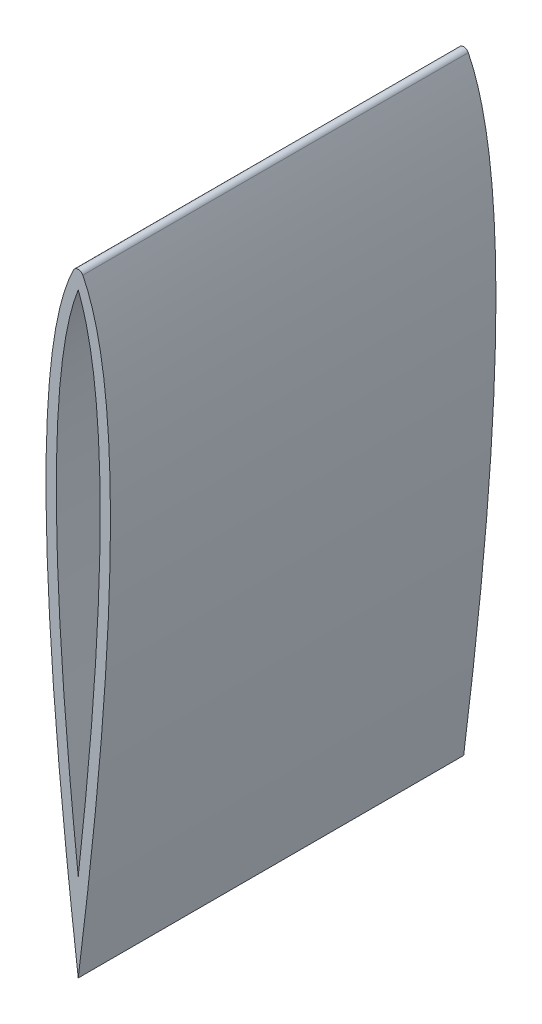
ISO-10303-21;
HEADER;
FILE_DESCRIPTION(('STEP AP214'),'2;1');
FILE_NAME('part.step','',(''),(''),'','','');
FILE_SCHEMA(('AUTOMOTIVE_DESIGN { 1 0 10303 214 1 1 1 1 }'));
ENDSEC;
DATA;
#1=APPLICATION_CONTEXT('core data for automotive mechanical design processes');
#2=APPLICATION_PROTOCOL_DEFINITION('international standard','automotive_design',2000,#1);
#3=PRODUCT_CONTEXT('',#1,'mechanical');
#4=PRODUCT('Part','Part','',(#3));
#5=PRODUCT_RELATED_PRODUCT_CATEGORY('part','',(#4));
#6=PRODUCT_DEFINITION_FORMATION('','',#4);
#7=PRODUCT_DEFINITION_CONTEXT('part definition',#1,'design');
#8=PRODUCT_DEFINITION('design','',#6,#7);
#9=PRODUCT_DEFINITION_SHAPE('','',#8);
#10=(LENGTH_UNIT() NAMED_UNIT(*) SI_UNIT(.MILLI.,.METRE.));
#11=(NAMED_UNIT(*) PLANE_ANGLE_UNIT() SI_UNIT($,.RADIAN.));
#12=(NAMED_UNIT(*) SI_UNIT($,.STERADIAN.) SOLID_ANGLE_UNIT());
#13=UNCERTAINTY_MEASURE_WITH_UNIT(LENGTH_MEASURE(1.E-05),#10,'distance_accuracy_value','');
#14=(GEOMETRIC_REPRESENTATION_CONTEXT(3) GLOBAL_UNCERTAINTY_ASSIGNED_CONTEXT((#13)) GLOBAL_UNIT_ASSIGNED_CONTEXT((#10,
#11,#12)) REPRESENTATION_CONTEXT('',''));
#15=CARTESIAN_POINT('',(0.,0.,0.));
#16=DIRECTION('',(0.,0.,1.));
#17=DIRECTION('',(1.,0.,0.));
#18=AXIS2_PLACEMENT_3D('',#15,#16,#17);
#19=CARTESIAN_POINT('',(15.853163035224,45.1076472609895,94.869));
#20=DIRECTION('',(0.,0.,1.));
#21=DIRECTION('',(1.,0.,0.));
#22=AXIS2_PLACEMENT_3D('',#19,#20,#21);
#23=PLANE('',#22);
#24=CARTESIAN_POINT('',(0.,-152.4,94.869));
#25=CARTESIAN_POINT('',(30.5724401232739,92.2411110099885,94.869));
#26=CARTESIAN_POINT('',(2.26777189434819,148.348367023981,94.869));
#27=B_SPLINE_CURVE_WITH_KNOTS('',2,(#24,#25,#26),.UNSPECIFIED.,.F.,.F.,(3,3),(0.,1.),.UNSPECIFIED.);
#28=CARTESIAN_POINT('',(0.,-152.4,94.869));
#29=VERTEX_POINT('',#28);
#30=CARTESIAN_POINT('',(2.26777189434819,148.348367023981,94.869));
#31=VERTEX_POINT('',#30);
#32=EDGE_CURVE('E145',#29,#31,#27,.T.);
#33=ORIENTED_EDGE('',*,*,#32,.T.);
#34=CARTESIAN_POINT('',(0.,147.204334404164,94.869));
#35=DIRECTION('',(0.,0.,1.));
#36=DIRECTION('',(-1.,0.,0.));
#37=AXIS2_PLACEMENT_3D('',#34,#35,#36);
#38=CIRCLE('',#37,2.53999999999999);
#39=CARTESIAN_POINT('',(-2.26777189434819,148.348367023981,94.869));
#40=VERTEX_POINT('',#39);
#41=EDGE_CURVE('E127',#31,#40,#38,.T.);
#42=ORIENTED_EDGE('',*,*,#41,.T.);
#43=CARTESIAN_POINT('',(-2.26777189434819,148.348367023981,94.869));
#44=CARTESIAN_POINT('',(-30.5724401232739,92.2411110099885,94.869));
#45=CARTESIAN_POINT('',(0.,-152.4,94.869));
#46=B_SPLINE_CURVE_WITH_KNOTS('',2,(#43,#44,#45),.UNSPECIFIED.,.F.,.F.,(3,3),(0.,1.),.UNSPECIFIED.);
#47=EDGE_CURVE('E120',#40,#29,#46,.T.);
#48=ORIENTED_EDGE('',*,*,#47,.T.);
#49=EDGE_LOOP('',(#33,#42,#48));
#50=FACE_BOUND('',#49,.T.);
#51=CARTESIAN_POINT('',(0.,-109.125318419714,94.869));
#52=CARTESIAN_POINT('',(8.16373796542807,-35.5088464124318,94.869));
#53=CARTESIAN_POINT('',(11.1456655969047,45.0401668444738,94.869));
#54=CARTESIAN_POINT('',(10.2425746417,81.4333456049166,94.869));
#55=CARTESIAN_POINT('',(8.16937817155045,106.055563129854,94.869));
#56=CARTESIAN_POINT('',(3.91848207404641,131.156065716608,94.869));
#57=CARTESIAN_POINT('',(0.,140.978035644634,94.869));
#58=B_SPLINE_CURVE_WITH_KNOTS('',2,(#51,#52,#53,#54,#55,#56,#57),.UNSPECIFIED.,.F.,.F.,(3,1,1,1,
1,3),(0.0455268147428226,0.369534324590266,0.531538079513987,0.639540582796468,
0.747543086078949,0.909546841002671),.UNSPECIFIED.);
#59=CARTESIAN_POINT('',(0.,-109.125318419714,94.869));
#60=VERTEX_POINT('',#59);
#61=CARTESIAN_POINT('',(0.,140.978035644634,94.869));
#62=VERTEX_POINT('',#61);
#63=EDGE_CURVE('E81',#60,#62,#58,.T.);
#64=ORIENTED_EDGE('',*,*,#63,.F.);
#65=CARTESIAN_POINT('',(0.,140.978035644635,94.869));
#66=CARTESIAN_POINT('',(-3.91848207404643,131.156065716608,94.869));
#67=CARTESIAN_POINT('',(-8.16937817155045,106.055563129853,94.869));
#68=CARTESIAN_POINT('',(-10.2425746417,81.4333456049166,94.869));
#69=CARTESIAN_POINT('',(-11.1456655969047,45.0401668444737,94.869));
#70=CARTESIAN_POINT('',(-8.16373796542806,-35.5088464124318,94.869));
#71=CARTESIAN_POINT('',(0.,-109.125318419714,94.869));
#72=B_SPLINE_CURVE_WITH_KNOTS('',2,(#65,#66,#67,#68,#69,#70,#71),.UNSPECIFIED.,.F.,.F.,(3,1,1,1,
1,3),(0.0455268147428228,0.207530569666544,0.315533072949025,0.423535576231506,
0.585539331155228,0.909546841002671),.UNSPECIFIED.);
#73=EDGE_CURVE('E87',#62,#60,#72,.T.);
#74=ORIENTED_EDGE('',*,*,#73,.F.);
#75=EDGE_LOOP('',(#64,#74));
#76=FACE_BOUND('',#75,.T.);
#77=ADVANCED_FACE('F34',(#50,#76),#23,.T.);
#78=CARTESIAN_POINT('',(15.853163035224,45.1076472609895,-94.869));
#79=DIRECTION('',(0.,0.,1.));
#80=DIRECTION('',(1.,0.,0.));
#81=AXIS2_PLACEMENT_3D('',#78,#79,#80);
#82=PLANE('',#81);
#83=CARTESIAN_POINT('',(0.,-152.4,-94.869));
#84=CARTESIAN_POINT('',(30.5724401232739,92.2411110099885,-94.869));
#85=CARTESIAN_POINT('',(2.26777189434819,148.348367023981,-94.869));
#86=B_SPLINE_CURVE_WITH_KNOTS('',2,(#83,#84,#85),.UNSPECIFIED.,.F.,.F.,(3,3),(0.,1.),.UNSPECIFIED.);
#87=CARTESIAN_POINT('',(0.,-152.4,-94.869));
#88=VERTEX_POINT('',#87);
#89=CARTESIAN_POINT('',(2.26777189434819,148.348367023981,-94.869));
#90=VERTEX_POINT('',#89);
#91=EDGE_CURVE('E128',#88,#90,#86,.T.);
#92=ORIENTED_EDGE('',*,*,#91,.F.);
#93=CARTESIAN_POINT('',(-2.26777189434819,148.348367023981,-94.869));
#94=CARTESIAN_POINT('',(-30.5724401232739,92.2411110099885,-94.869));
#95=CARTESIAN_POINT('',(0.,-152.4,-94.869));
#96=B_SPLINE_CURVE_WITH_KNOTS('',2,(#93,#94,#95),.UNSPECIFIED.,.F.,.F.,(3,3),(0.,1.),.UNSPECIFIED.);
#97=CARTESIAN_POINT('',(-2.26777189434819,148.348367023981,-94.869));
#98=VERTEX_POINT('',#97);
#99=EDGE_CURVE('E141',#98,#88,#96,.T.);
#100=ORIENTED_EDGE('',*,*,#99,.F.);
#101=CARTESIAN_POINT('',(0.,147.204334404164,-94.869));
#102=DIRECTION('',(0.,0.,1.));
#103=DIRECTION('',(-1.,0.,0.));
#104=AXIS2_PLACEMENT_3D('',#101,#102,#103);
#105=CIRCLE('',#104,2.53999999999999);
#106=EDGE_CURVE('E136',#90,#98,#105,.T.);
#107=ORIENTED_EDGE('',*,*,#106,.F.);
#108=EDGE_LOOP('',(#92,#100,#107));
#109=FACE_BOUND('',#108,.T.);
#110=CARTESIAN_POINT('',(0.,140.978035644635,-94.869));
#111=CARTESIAN_POINT('',(-3.91848207404643,131.156065716608,-94.869));
#112=CARTESIAN_POINT('',(-8.16937817155045,106.055563129853,-94.869));
#113=CARTESIAN_POINT('',(-10.2425746417,81.4333456049166,-94.869));
#114=CARTESIAN_POINT('',(-11.1456655969047,45.0401668444737,-94.869));
#115=CARTESIAN_POINT('',(-8.16373796542806,-35.5088464124318,-94.869));
#116=CARTESIAN_POINT('',(0.,-109.125318419714,-94.869));
#117=B_SPLINE_CURVE_WITH_KNOTS('',2,(#110,#111,#112,#113,#114,#115,#116),.UNSPECIFIED.,.F.,.F.,
(3,1,1,1,1,3),(0.0455268147428228,0.207530569666544,0.315533072949025,0.423535576231506,
0.585539331155228,0.909546841002671),.UNSPECIFIED.);
#118=CARTESIAN_POINT('',(0.,140.978035644634,-94.869));
#119=VERTEX_POINT('',#118);
#120=CARTESIAN_POINT('',(0.,-109.125318419714,-94.869));
#121=VERTEX_POINT('',#120);
#122=EDGE_CURVE('E57',#119,#121,#117,.T.);
#123=ORIENTED_EDGE('',*,*,#122,.T.);
#124=CARTESIAN_POINT('',(0.,-109.125318419714,-94.869));
#125=CARTESIAN_POINT('',(8.16373796542807,-35.5088464124318,-94.869));
#126=CARTESIAN_POINT('',(11.1456655969047,45.0401668444738,-94.869));
#127=CARTESIAN_POINT('',(10.2425746417,81.4333456049166,-94.869));
#128=CARTESIAN_POINT('',(8.16937817155045,106.055563129854,-94.869));
#129=CARTESIAN_POINT('',(3.91848207404641,131.156065716608,-94.869));
#130=CARTESIAN_POINT('',(0.,140.978035644634,-94.869));
#131=B_SPLINE_CURVE_WITH_KNOTS('',2,(#124,#125,#126,#127,#128,#129,#130),.UNSPECIFIED.,.F.,.F.,
(3,1,1,1,1,3),(0.0455268147428226,0.369534324590266,0.531538079513987,0.639540582796468,
0.747543086078949,0.909546841002671),.UNSPECIFIED.);
#132=EDGE_CURVE('E91',#121,#119,#131,.T.);
#133=ORIENTED_EDGE('',*,*,#132,.T.);
#134=EDGE_LOOP('',(#123,#133));
#135=FACE_BOUND('',#134,.T.);
#136=ADVANCED_FACE('F111',(#109,#135),#82,.F.);
#137=DIRECTION('',(0.,0.,-1.));
#138=VECTOR('',#137,1.);
#139=SURFACE_OF_LINEAR_EXTRUSION('',#27,#138);
#140=ORIENTED_EDGE('',*,*,#91,.T.);
#141=DIRECTION('',(0.,0.,-1.));
#142=VECTOR('',#141,1.);
#143=CARTESIAN_POINT('',(2.26777189434819,148.348367023981,94.869));
#144=LINE('',#143,#142);
#145=EDGE_CURVE('E11',#31,#90,#144,.T.);
#146=ORIENTED_EDGE('',*,*,#145,.F.);
#147=ORIENTED_EDGE('',*,*,#32,.F.);
#148=DIRECTION('',(0.,0.,-1.));
#149=VECTOR('',#148,1.);
#150=CARTESIAN_POINT('',(0.,-152.4,94.869));
#151=LINE('',#150,#149);
#152=EDGE_CURVE('E126',#29,#88,#151,.T.);
#153=ORIENTED_EDGE('',*,*,#152,.T.);
#154=EDGE_LOOP('',(#140,#146,#147,#153));
#155=FACE_BOUND('',#154,.T.);
#156=ADVANCED_FACE('F36',(#155),#139,.F.);
#157=CARTESIAN_POINT('',(0.,147.204334404164,94.869));
#158=DIRECTION('',(0.,0.,-1.));
#159=DIRECTION('',(-1.,0.,0.));
#160=AXIS2_PLACEMENT_3D('',#157,#158,#159);
#161=CYLINDRICAL_SURFACE('',#160,2.53999999999999);
#162=ORIENTED_EDGE('',*,*,#106,.T.);
#163=DIRECTION('',(0.,0.,-1.));
#164=VECTOR('',#163,1.);
#165=CARTESIAN_POINT('',(-2.26777189434819,148.348367023981,94.869));
#166=LINE('',#165,#164);
#167=EDGE_CURVE('E43',#40,#98,#166,.T.);
#168=ORIENTED_EDGE('',*,*,#167,.F.);
#169=ORIENTED_EDGE('',*,*,#41,.F.);
#170=ORIENTED_EDGE('',*,*,#145,.T.);
#171=EDGE_LOOP('',(#162,#168,#169,#170));
#172=FACE_BOUND('',#171,.T.);
#173=ADVANCED_FACE('F118',(#172),#161,.T.);
#174=DIRECTION('',(0.,0.,-1.));
#175=VECTOR('',#174,1.);
#176=SURFACE_OF_LINEAR_EXTRUSION('',#46,#175);
#177=ORIENTED_EDGE('',*,*,#99,.T.);
#178=ORIENTED_EDGE('',*,*,#152,.F.);
#179=ORIENTED_EDGE('',*,*,#47,.F.);
#180=ORIENTED_EDGE('',*,*,#167,.T.);
#181=EDGE_LOOP('',(#177,#178,#179,#180));
#182=FACE_BOUND('',#181,.T.);
#183=ADVANCED_FACE('F108',(#182),#176,.F.);
#184=DIRECTION('',(0.,0.,-1.));
#185=VECTOR('',#184,1.);
#186=SURFACE_OF_LINEAR_EXTRUSION('',#72,#185);
#187=ORIENTED_EDGE('',*,*,#122,.F.);
#188=DIRECTION('',(0.,0.,-1.));
#189=VECTOR('',#188,1.);
#190=CARTESIAN_POINT('',(0.,140.978035644634,94.869));
#191=LINE('',#190,#189);
#192=EDGE_CURVE('E83',#62,#119,#191,.T.);
#193=ORIENTED_EDGE('',*,*,#192,.F.);
#194=ORIENTED_EDGE('',*,*,#73,.T.);
#195=DIRECTION('',(0.,0.,-1.));
#196=VECTOR('',#195,1.);
#197=CARTESIAN_POINT('',(0.,-109.125318419714,94.869));
#198=LINE('',#197,#196);
#199=EDGE_CURVE('E50',#60,#121,#198,.T.);
#200=ORIENTED_EDGE('',*,*,#199,.T.);
#201=EDGE_LOOP('',(#187,#193,#194,#200));
#202=FACE_BOUND('',#201,.T.);
#203=ADVANCED_FACE('F89',(#202),#186,.T.);
#204=DIRECTION('',(0.,0.,-1.));
#205=VECTOR('',#204,1.);
#206=SURFACE_OF_LINEAR_EXTRUSION('',#58,#205);
#207=ORIENTED_EDGE('',*,*,#132,.F.);
#208=ORIENTED_EDGE('',*,*,#199,.F.);
#209=ORIENTED_EDGE('',*,*,#63,.T.);
#210=ORIENTED_EDGE('',*,*,#192,.T.);
#211=EDGE_LOOP('',(#207,#208,#209,#210));
#212=FACE_BOUND('',#211,.T.);
#213=ADVANCED_FACE('F82',(#212),#206,.T.);
#214=CLOSED_SHELL('',(#77,#136,#156,#173,#183,#203,#213));
#215=MANIFOLD_SOLID_BREP('B2',#214);
#216=ADVANCED_BREP_SHAPE_REPRESENTATION('',(#18,#215),#14);
#217=SHAPE_DEFINITION_REPRESENTATION(#9,#216);
ENDSEC;
END-ISO-10303-21;
